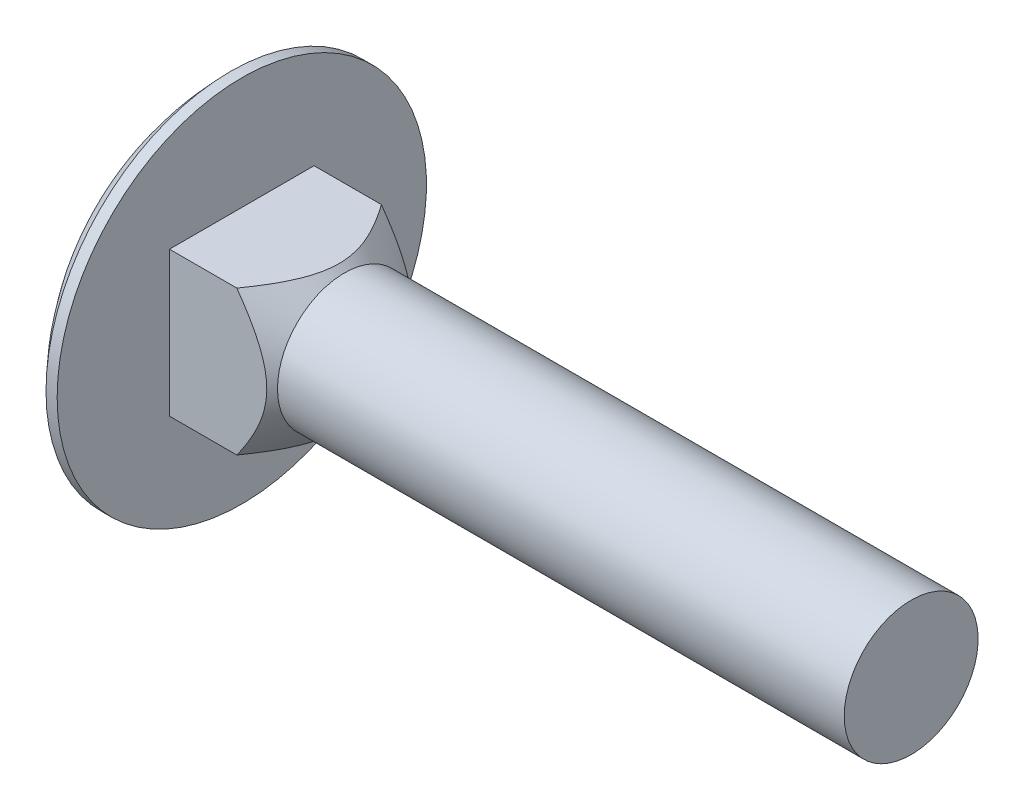
ISO-10303-21;
HEADER;
FILE_DESCRIPTION(('STEP AP214'),'2;1');
FILE_NAME('part.step','',(''),(''),'','','');
FILE_SCHEMA(('AUTOMOTIVE_DESIGN { 1 0 10303 214 1 1 1 1 }'));
ENDSEC;
DATA;
#1=APPLICATION_CONTEXT('core data for automotive mechanical design processes');
#2=APPLICATION_PROTOCOL_DEFINITION('international standard','automotive_design',2000,#1);
#3=PRODUCT_CONTEXT('',#1,'mechanical');
#4=PRODUCT('Part','Part','',(#3));
#5=PRODUCT_RELATED_PRODUCT_CATEGORY('part','',(#4));
#6=PRODUCT_DEFINITION_FORMATION('','',#4);
#7=PRODUCT_DEFINITION_CONTEXT('part definition',#1,'design');
#8=PRODUCT_DEFINITION('design','',#6,#7);
#9=PRODUCT_DEFINITION_SHAPE('','',#8);
#10=(LENGTH_UNIT() NAMED_UNIT(*) SI_UNIT(.MILLI.,.METRE.));
#11=(NAMED_UNIT(*) PLANE_ANGLE_UNIT() SI_UNIT($,.RADIAN.));
#12=(NAMED_UNIT(*) SI_UNIT($,.STERADIAN.) SOLID_ANGLE_UNIT());
#13=UNCERTAINTY_MEASURE_WITH_UNIT(LENGTH_MEASURE(1.E-05),#10,'distance_accuracy_value','');
#14=(GEOMETRIC_REPRESENTATION_CONTEXT(3) GLOBAL_UNCERTAINTY_ASSIGNED_CONTEXT((#13)) GLOBAL_UNIT_ASSIGNED_CONTEXT((#10,
#11,#12)) REPRESENTATION_CONTEXT('',''));
#15=CARTESIAN_POINT('',(0.,0.,0.));
#16=DIRECTION('',(0.,0.,1.));
#17=DIRECTION('',(1.,0.,0.));
#18=AXIS2_PLACEMENT_3D('',#15,#16,#17);
#19=CARTESIAN_POINT('',(4.6,3.24,-3.24));
#20=DIRECTION('',(0.,0.,1.));
#21=DIRECTION('',(0.,-1.,0.));
#22=AXIS2_PLACEMENT_3D('',#19,#20,#21);
#23=PLANE('',#22);
#24=CARTESIAN_POINT('',(0.120416170125069,-6.7414074397063,-3.24));
#25=CARTESIAN_POINT('',(0.25736062873696,-6.58944728740927,-3.24));
#26=CARTESIAN_POINT('',(0.393846815573473,-6.43707070925382,-3.24));
#27=CARTESIAN_POINT('',(0.665661123863793,-6.1312671177515,-3.24));
#28=CARTESIAN_POINT('',(0.800989152901168,-5.97784002230384,-3.24));
#29=CARTESIAN_POINT('',(1.07065702082592,-5.66924612356482,-3.24));
#30=CARTESIAN_POINT('',(1.20499227924482,-5.51407531108393,-3.24));
#31=CARTESIAN_POINT('',(1.47186716195841,-5.20220433515908,-3.24));
#32=CARTESIAN_POINT('',(1.60440684975769,-5.04550422614131,-3.24));
#33=CARTESIAN_POINT('',(1.87469625252643,-4.72122756794267,-3.24));
#34=CARTESIAN_POINT('',(2.0123128694796,-4.55353979098877,-3.24));
#35=CARTESIAN_POINT('',(2.28420008970127,-4.21547552728753,-3.24));
#36=CARTESIAN_POINT('',(2.41847084769173,-4.04509916546525,-3.24));
#37=CARTESIAN_POINT('',(2.68232627861573,-3.70109336187763,-3.24));
#38=CARTESIAN_POINT('',(2.8119168313737,-3.52746844969524,-3.24));
#39=CARTESIAN_POINT('',(3.06482061537789,-3.17572665708054,-3.24));
#40=CARTESIAN_POINT('',(3.1881354498348,-2.99761094144419,-3.24));
#41=CARTESIAN_POINT('',(3.39832133154884,-2.67722310032235,-3.24));
#42=CARTESIAN_POINT('',(3.48703467285581,-2.53616652454108,-3.24));
#43=CARTESIAN_POINT('',(3.65726255713617,-2.24964032099177,-3.24));
#44=CARTESIAN_POINT('',(3.73877395380492,-2.10416880139295,-3.24));
#45=CARTESIAN_POINT('',(3.89115652633997,-1.80934032100822,-3.24));
#46=CARTESIAN_POINT('',(3.9621164219209,-1.6600298009873,-3.24));
#47=CARTESIAN_POINT('',(4.09050683146268,-1.35569473684555,-3.24));
#48=CARTESIAN_POINT('',(4.14795039693274,-1.20067587347206,-3.24));
#49=CARTESIAN_POINT('',(4.22558846779131,-0.947273628729252,-3.24));
#50=CARTESIAN_POINT('',(4.25153996125965,-0.850655334613169,-3.24));
#51=CARTESIAN_POINT('',(4.29568982309763,-0.655648600709393,-3.24));
#52=CARTESIAN_POINT('',(4.31388942032129,-0.557260444064855,-3.24));
#53=CARTESIAN_POINT('',(4.34156684156055,-0.359610820542335,-3.24));
#54=CARTESIAN_POINT('',(4.35107602439263,-0.260353808887043,-3.24));
#55=CARTESIAN_POINT('',(4.36094183170725,-0.0613794653984506,-3.24));
#56=CARTESIAN_POINT('',(4.36129862388183,0.0383378579674386,-3.24));
#57=CARTESIAN_POINT('',(4.35283832123334,0.237378603091908,-3.24));
#58=CARTESIAN_POINT('',(4.34402096142676,0.336702013389639,-3.24));
#59=CARTESIAN_POINT('',(4.31771918406241,0.534183700378543,-3.24));
#60=CARTESIAN_POINT('',(4.30023406582596,0.632341882218774,-3.24));
#61=CARTESIAN_POINT('',(4.2573945237995,0.827349246915,-3.24));
#62=CARTESIAN_POINT('',(4.23200622025648,0.92419088407423,-3.24));
#63=CARTESIAN_POINT('',(4.17446445699154,1.11581908212014,-3.24));
#64=CARTESIAN_POINT('',(4.14231079903122,1.21060558269742,-3.24));
#65=CARTESIAN_POINT('',(4.06453950116689,1.41886565569307,-3.24));
#66=CARTESIAN_POINT('',(4.01751768475131,1.53181153534013,-3.24));
#67=CARTESIAN_POINT('',(3.91671541361205,1.75467118579228,-3.24));
#68=CARTESIAN_POINT('',(3.86293162642795,1.86458342875213,-3.24));
#69=CARTESIAN_POINT('',(3.74994199449218,2.08181831427032,-3.24));
#70=CARTESIAN_POINT('',(3.6907264258951,2.18913586031061,-3.24));
#71=CARTESIAN_POINT('',(3.56808414719841,2.4012987068335,-3.24));
#72=CARTESIAN_POINT('',(3.50465808606051,2.506144384944,-3.24));
#73=CARTESIAN_POINT('',(3.37351714683084,2.71519344454569,-3.24));
#74=CARTESIAN_POINT('',(3.30575408304881,2.81936645688851,-3.24));
#75=CARTESIAN_POINT('',(3.16745091463218,3.02584962244193,-3.24));
#76=CARTESIAN_POINT('',(3.09691072677368,3.12815971969076,-3.24));
#77=CARTESIAN_POINT('',(2.95366014171693,3.33107037702131,-3.24));
#78=CARTESIAN_POINT('',(2.88095230175738,3.4316727476446,-3.24));
#79=CARTESIAN_POINT('',(2.73369585527417,3.63151137580475,-3.24));
#80=CARTESIAN_POINT('',(2.65914732418408,3.73074768906542,-3.24));
#81=CARTESIAN_POINT('',(2.48904411673983,3.95356950466048,-3.24));
#82=CARTESIAN_POINT('',(2.3930434080346,4.07681415039384,-3.24));
#83=CARTESIAN_POINT('',(2.19910117753357,4.32176885465257,-3.24));
#84=CARTESIAN_POINT('',(2.10115959026957,4.44347886118535,-3.24));
#85=CARTESIAN_POINT('',(1.80496346206786,4.80672536138743,-3.24));
#86=CARTESIAN_POINT('',(1.60436164100984,5.04634718705188,-3.24));
#87=CARTESIAN_POINT('',(1.19880495079559,5.52205280844775,-3.24));
#88=CARTESIAN_POINT('',(0.99384804230474,5.75813485425661,-3.24));
#89=CARTESIAN_POINT('',(0.580866742988496,6.22760655736332,-3.24));
#90=CARTESIAN_POINT('',(0.372842273678394,6.46099614550038,-3.24));
#91=CARTESIAN_POINT('',(-0.0459273377027709,6.92624626345974,-3.24));
#92=CARTESIAN_POINT('',(-0.256677452858743,7.15810230761016,-3.24));
#93=CARTESIAN_POINT('',(-0.679912188418046,7.62023065825678,-3.24));
#94=CARTESIAN_POINT('',(-0.892396836514393,7.85050293935853,-3.24));
#95=CARTESIAN_POINT('',(-1.53171588603127,8.53932562776742,-3.24));
#96=CARTESIAN_POINT('',(-1.96054444439081,8.99602419698945,-3.24));
#97=CARTESIAN_POINT('',(-2.7673025022011,9.8488450921901,-3.24));
#98=CARTESIAN_POINT('',(-3.14483337056159,10.245345825622,-3.24));
#99=CARTESIAN_POINT('',(-3.90178375614314,11.0366083515061,-3.24));
#100=CARTESIAN_POINT('',(-4.28120344027272,11.4313699842537,-3.24));
#101=CARTESIAN_POINT('',(-5.03996312949916,12.2180953360151,-3.24));
#102=CARTESIAN_POINT('',(-5.41929802192966,12.6100639911261,-3.24));
#103=CARTESIAN_POINT('',(-6.17897101237118,13.3929516667823,-3.24));
#104=CARTESIAN_POINT('',(-6.55930900565716,13.7838707889211,-3.24));
#105=CARTESIAN_POINT('',(-6.94001542155328,14.1744293874219,-3.24));
#106=B_SPLINE_CURVE_WITH_KNOTS('',3,(#24,#25,#26,#27,#28,#29,#30,#31,#32,#33,#34,#35,#36,#37,
#38,#39,#40,#41,#42,#43,#44,#45,#46,#47,#48,#49,#50,#51,#52,#53,#54,#55,#56,#57,#58,#59,#60,#61,
#62,#63,#64,#65,#66,#67,#68,#69,#70,#71,#72,#73,#74,#75,#76,#77,#78,#79,#80,#81,#82,#83,#84,#85,
#86,#87,#88,#89,#90,#91,#92,#93,#94,#95,#96,#97,#98,#99,#100,#101,#102,#103,#104,#105),
.UNSPECIFIED.,.F.,.F.,(4,2,2,2,2,2,2,2,2,2,2,2,2,2,2,2,2,2,2,2,2,2,2,2,2,2,2,2,2,2,2,2,2,2,2,2,
2,2,2,2,4),(0.,0.613689317340484,1.22742715643208,1.84313970014903,2.45883041058956,
3.10958114212511,3.76030172505684,4.41017414568678,5.05987970622939,5.55962946354488,
6.05959647742213,6.5550877515697,7.05009859249719,7.3499622059646,7.64977826643814,
7.94850813791696,8.24723253599984,8.54596556258943,8.84472274190593,9.14477870724488,
9.44484346604788,9.81158365654415,10.1785052990716,10.5460971159382,10.9136324069677,
11.2863975997142,11.6591739718763,12.0315267342691,12.403864262477,12.872505272666,
13.3411621176853,14.2785938914772,15.2164747516066,16.1543796495519,17.0943450525182,
18.0343254921471,19.9137100660878,21.5561663210808,23.1987703864368,24.8351697964812,
26.471404639992),.UNSPECIFIED.);
#107=CARTESIAN_POINT('',(3.01794805791106,-3.24,-3.24000000000061));
#108=VERTEX_POINT('',#107);
#109=CARTESIAN_POINT('',(3.01794805791106,3.24,-3.24000000000061));
#110=VERTEX_POINT('',#109);
#111=EDGE_CURVE('E96',#108,#110,#106,.T.);
#112=ORIENTED_EDGE('',*,*,#111,.F.);
#113=DIRECTION('',(-1.,0.,0.));
#114=VECTOR('',#113,1.);
#115=CARTESIAN_POINT('',(4.6,-3.24,-3.24));
#116=LINE('',#115,#114);
#117=CARTESIAN_POINT('',(0.,-3.24,-3.24));
#118=VERTEX_POINT('',#117);
#119=EDGE_CURVE('E105',#108,#118,#116,.T.);
#120=ORIENTED_EDGE('',*,*,#119,.T.);
#121=DIRECTION('',(0.,1.,0.));
#122=VECTOR('',#121,1.);
#123=CARTESIAN_POINT('',(0.,3.24,-3.24));
#124=LINE('',#123,#122);
#125=CARTESIAN_POINT('',(0.,3.24,-3.24));
#126=VERTEX_POINT('',#125);
#127=EDGE_CURVE('E108',#118,#126,#124,.T.);
#128=ORIENTED_EDGE('',*,*,#127,.T.);
#129=DIRECTION('',(-1.,0.,0.));
#130=VECTOR('',#129,1.);
#131=CARTESIAN_POINT('',(4.6,3.24,-3.24));
#132=LINE('',#131,#130);
#133=EDGE_CURVE('E70',#110,#126,#132,.T.);
#134=ORIENTED_EDGE('',*,*,#133,.F.);
#135=EDGE_LOOP('',(#112,#120,#128,#134));
#136=FACE_BOUND('',#135,.T.);
#137=ADVANCED_FACE('F40',(#136),#23,.F.);
#138=CARTESIAN_POINT('',(4.6,3.24,3.24));
#139=DIRECTION('',(0.,-1.,0.));
#140=DIRECTION('',(0.,0.,-1.));
#141=AXIS2_PLACEMENT_3D('',#138,#139,#140);
#142=PLANE('',#141);
#143=CARTESIAN_POINT('',(0.120416397012247,3.24,-6.74140718797523));
#144=CARTESIAN_POINT('',(0.25736084617149,3.24,-6.5894470451034));
#145=CARTESIAN_POINT('',(0.393847023566096,3.24,-6.43707047638589));
#146=CARTESIAN_POINT('',(0.665661313010063,3.24,-6.13126690380304));
#147=CARTESIAN_POINT('',(0.800989332643002,3.24,-5.97783981783692));
#148=CARTESIAN_POINT('',(1.07065718176657,3.24,-5.66924593817143));
#149=CARTESIAN_POINT('',(1.20499243078909,3.24,-5.51407513528287));
#150=CARTESIAN_POINT('',(1.47186729479663,3.24,-5.2022041786282));
#151=CARTESIAN_POINT('',(1.60440697328623,3.24,-5.04550407928825));
#152=CARTESIAN_POINT('',(1.87469635953515,3.24,-4.72122743813245));
#153=CARTESIAN_POINT('',(2.01231296924024,3.24,-4.5535396685128));
#154=CARTESIAN_POINT('',(2.28420017506167,3.24,-4.21547541958202));
#155=CARTESIAN_POINT('',(2.41847092589994,3.24,-4.04509906519593));
#156=CARTESIAN_POINT('',(2.68232634270415,3.24,-3.70109327662581));
#157=CARTESIAN_POINT('',(2.81191688849407,3.24,-3.52746837202434));
#158=CARTESIAN_POINT('',(3.06482065885818,3.24,-3.17572659482914));
#159=CARTESIAN_POINT('',(3.18813548664283,3.24,-2.9976108870312));
#160=CARTESIAN_POINT('',(3.39832137140359,3.24,-2.67722303827205));
#161=CARTESIAN_POINT('',(3.48703472147538,3.24,-2.53616644637704));
#162=CARTESIAN_POINT('',(3.65726262123822,3.24,-2.24964020941729));
#163=CARTESIAN_POINT('',(3.73877402462226,3.24,-2.10416867252039));
#164=CARTESIAN_POINT('',(3.89115660683942,3.24,-1.80934015718243));
#165=CARTESIAN_POINT('',(3.96211650547658,3.24,-1.66002961955079));
#166=CARTESIAN_POINT('',(4.09050691644272,3.24,-1.35569451884629));
#167=CARTESIAN_POINT('',(4.14795048029365,3.24,-1.20067563652576));
#168=CARTESIAN_POINT('',(4.22558854094651,3.24,-0.947273368688294));
#169=CARTESIAN_POINT('',(4.25154002842363,3.24,-0.850655070821967));
#170=CARTESIAN_POINT('',(4.29568987701632,3.24,-0.655648329724568));
#171=CARTESIAN_POINT('',(4.31388946698645,3.24,-0.557260169636679));
#172=CARTESIAN_POINT('',(4.3415668726833,3.24,-0.359610539727296));
#173=CARTESIAN_POINT('',(4.35107604722261,3.24,-0.260353525125297));
#174=CARTESIAN_POINT('',(4.36094183727395,3.24,-0.0613791765202277));
#175=CARTESIAN_POINT('',(4.36129862047733,3.24,0.0383381490154808));
#176=CARTESIAN_POINT('',(4.35283829977402,3.24,0.237378896931347));
#177=CARTESIAN_POINT('',(4.34402093094838,3.24,0.336702307853424));
#178=CARTESIAN_POINT('',(4.31771913602471,3.24,0.534183995381723));
#179=CARTESIAN_POINT('',(4.30023400924767,3.24,0.632342177136899));
#180=CARTESIAN_POINT('',(4.2573944508867,3.24,0.827349541250184));
#181=CARTESIAN_POINT('',(4.23200613954735,3.24,0.924191177908111));
#182=CARTESIAN_POINT('',(4.17446436161367,3.24,1.11581937468146));
#183=CARTESIAN_POINT('',(4.14231069678194,3.24,1.21060587448777));
#184=CARTESIAN_POINT('',(4.06453937359323,3.24,1.41886597532059));
#185=CARTESIAN_POINT('',(4.01751753675131,3.24,1.53181188273558));
#186=CARTESIAN_POINT('',(3.9167152228558,3.24,1.75467158732018));
#187=CARTESIAN_POINT('',(3.86293141333946,3.24,1.86458385664321));
#188=CARTESIAN_POINT('',(3.74994173551611,3.24,2.08181879394348));
#189=CARTESIAN_POINT('',(3.69072614335789,3.24,2.18913636539877));
#190=CARTESIAN_POINT('',(3.56808381687153,3.24,2.40129926196509));
#191=CARTESIAN_POINT('',(3.50465773150558,3.24,2.50614496470436));
#192=CARTESIAN_POINT('',(3.37351674319998,3.24,2.71519407318998));
#193=CARTESIAN_POINT('',(3.30575365457046,3.24,2.81936710978396));
#194=CARTESIAN_POINT('',(3.16745043625327,3.24,3.0258503234668));
#195=CARTESIAN_POINT('',(3.09691022334166,3.24,3.12816044459382));
#196=CARTESIAN_POINT('',(2.95365958814427,3.24,3.33107114935379));
#197=CARTESIAN_POINT('',(2.88095172309835,3.24,3.43167354352932));
#198=CARTESIAN_POINT('',(2.73369522641253,3.24,3.63151221862995));
#199=CARTESIAN_POINT('',(2.65914667020615,3.24,3.73074855527884));
#200=CARTESIAN_POINT('',(2.48904343477153,3.24,3.95357038594087));
#201=CARTESIAN_POINT('',(2.39304272392734,3.24,4.0768150238814));
#202=CARTESIAN_POINT('',(2.19910049024907,3.24,4.32176971330541));
#203=CARTESIAN_POINT('',(2.1011589019469,3.24,4.44347971279636));
#204=CARTESIAN_POINT('',(1.80496277189464,3.24,4.80672619272812));
#205=CARTESIAN_POINT('',(1.6043609512619,3.24,5.04634800605598));
#206=CARTESIAN_POINT('',(1.19880426395377,3.24,5.52205360419646));
#207=CARTESIAN_POINT('',(0.993847357946783,3.24,5.75813563908907));
#208=CARTESIAN_POINT('',(0.580866064862754,3.24,6.2276073213903));
#209=CARTESIAN_POINT('',(0.372841599301107,3.24,6.46099689963823));
#210=CARTESIAN_POINT('',(-0.0459280034415185,3.24,6.92624699817664));
#211=CARTESIAN_POINT('',(-0.256678113702332,3.24,7.15810303279974));
#212=CARTESIAN_POINT('',(-0.67991283888425,3.24,7.6202313648977));
#213=CARTESIAN_POINT('',(-0.892397481498328,3.24,7.85050363697815));
#214=CARTESIAN_POINT('',(-1.53171651409696,3.24,8.53932629901567));
#215=CARTESIAN_POINT('',(-1.96054506041448,3.24,8.99602485142915));
#216=CARTESIAN_POINT('',(-2.76730311748959,3.24,9.84884573981253));
#217=CARTESIAN_POINT('',(-3.14483399741388,3.24,10.245346482994));
#218=CARTESIAN_POINT('',(-3.90178440585234,3.24,11.0366090285592));
#219=CARTESIAN_POINT('',(-4.28120410127485,3.24,11.4313706712386));
#220=CARTESIAN_POINT('',(-5.03996381385811,3.24,12.2180960439803));
#221=CARTESIAN_POINT('',(-5.41929871835656,3.24,12.6100647101359));
#222=CARTESIAN_POINT('',(-6.178971732859,3.24,13.3929524080208));
#223=CARTESIAN_POINT('',(-6.55930973813807,3.24,13.7838715413436));
#224=CARTESIAN_POINT('',(-6.9400161659924,3.24,14.1744301510615));
#225=B_SPLINE_CURVE_WITH_KNOTS('',3,(#143,#144,#145,#146,#147,#148,#149,#150,#151,#152,#153,
#154,#155,#156,#157,#158,#159,#160,#161,#162,#163,#164,#165,#166,#167,#168,#169,#170,#171,#172,
#173,#174,#175,#176,#177,#178,#179,#180,#181,#182,#183,#184,#185,#186,#187,#188,#189,#190,#191,
#192,#193,#194,#195,#196,#197,#198,#199,#200,#201,#202,#203,#204,#205,#206,#207,#208,#209,#210,
#211,#212,#213,#214,#215,#216,#217,#218,#219,#220,#221,#222,#223,#224),.UNSPECIFIED.,.F.,.F.,(4,
2,2,2,2,2,2,2,2,2,2,2,2,2,2,2,2,2,2,2,2,2,2,2,2,2,2,2,2,2,2,2,2,2,2,2,2,2,2,2,4),(0.,
0.613689277351337,1.22742707644803,1.84313957995817,2.45883025019582,3.10958095092863,
3.76030150306009,4.41017389296157,5.05987942279953,5.55962923497038,6.05959630382794,
6.55508762939305,7.05009852138514,7.34996214097857,7.6497782075645,7.94850808540368,
8.24723248986966,8.54596552074054,8.84472270435129,9.1447786742277,9.44484343752451,
9.81158372833911,10.1785054713109,10.5460973890606,10.9136327809252,11.2863980753046,
11.6591745491081,12.0315274128546,12.4038650424204,12.8725060381386,13.3411628686666,
14.2785946133404,15.2164754438787,16.1543803122098,17.0943456841551,18.0343260927446,
19.9137106052134,21.5561669053119,23.1987710156277,24.8351704746596,26.4714053673087),.UNSPECIFIED.);
#226=CARTESIAN_POINT('',(3.01794805791122,3.24,3.24));
#227=VERTEX_POINT('',#226);
#228=EDGE_CURVE('E109',#110,#227,#225,.T.);
#229=ORIENTED_EDGE('',*,*,#228,.F.);
#230=ORIENTED_EDGE('',*,*,#133,.T.);
#231=DIRECTION('',(0.,0.,1.));
#232=VECTOR('',#231,1.);
#233=CARTESIAN_POINT('',(0.,3.24,3.24));
#234=LINE('',#233,#232);
#235=CARTESIAN_POINT('',(0.,3.24,3.24));
#236=VERTEX_POINT('',#235);
#237=EDGE_CURVE('E147',#126,#236,#234,.T.);
#238=ORIENTED_EDGE('',*,*,#237,.T.);
#239=DIRECTION('',(-1.,0.,0.));
#240=VECTOR('',#239,1.);
#241=CARTESIAN_POINT('',(4.6,3.24,3.24));
#242=LINE('',#241,#240);
#243=EDGE_CURVE('E121',#227,#236,#242,.T.);
#244=ORIENTED_EDGE('',*,*,#243,.F.);
#245=EDGE_LOOP('',(#229,#230,#238,#244));
#246=FACE_BOUND('',#245,.T.);
#247=ADVANCED_FACE('F165',(#246),#142,.F.);
#248=CARTESIAN_POINT('',(4.6,3.24,3.24));
#249=DIRECTION('',(0.,0.,-1.));
#250=DIRECTION('',(0.,1.,0.));
#251=AXIS2_PLACEMENT_3D('',#248,#249,#250);
#252=PLANE('',#251);
#253=CARTESIAN_POINT('',(0.120416397012249,-6.74140718797523,3.24));
#254=CARTESIAN_POINT('',(0.257360846171492,-6.5894470451034,3.24));
#255=CARTESIAN_POINT('',(0.393847023566098,-6.43707047638589,3.24));
#256=CARTESIAN_POINT('',(0.665661313010065,-6.13126690380304,3.24));
#257=CARTESIAN_POINT('',(0.800989332643003,-5.97783981783692,3.24));
#258=CARTESIAN_POINT('',(1.07065718176657,-5.66924593817143,3.24));
#259=CARTESIAN_POINT('',(1.20499243078909,-5.51407513528287,3.24));
#260=CARTESIAN_POINT('',(1.47186729479663,-5.2022041786282,3.24));
#261=CARTESIAN_POINT('',(1.60440697328623,-5.04550407928825,3.24));
#262=CARTESIAN_POINT('',(1.87469635953515,-4.72122743813245,3.24));
#263=CARTESIAN_POINT('',(2.01231296924024,-4.5535396685128,3.24));
#264=CARTESIAN_POINT('',(2.28420017506167,-4.21547541958203,3.24));
#265=CARTESIAN_POINT('',(2.41847092589994,-4.04509906519593,3.24));
#266=CARTESIAN_POINT('',(2.68232634270415,-3.70109327662581,3.24));
#267=CARTESIAN_POINT('',(2.81191688849407,-3.52746837202434,3.24));
#268=CARTESIAN_POINT('',(3.06482065885819,-3.17572659482914,3.24));
#269=CARTESIAN_POINT('',(3.18813548664283,-2.9976108870312,3.24));
#270=CARTESIAN_POINT('',(3.39832137140359,-2.67722303827205,3.24));
#271=CARTESIAN_POINT('',(3.48703472147538,-2.53616644637704,3.24));
#272=CARTESIAN_POINT('',(3.65726262123822,-2.2496402094173,3.24));
#273=CARTESIAN_POINT('',(3.73877402462226,-2.1041686725204,3.24));
#274=CARTESIAN_POINT('',(3.89115660683942,-1.80934015718244,3.24));
#275=CARTESIAN_POINT('',(3.96211650547658,-1.66002961955079,3.24));
#276=CARTESIAN_POINT('',(4.09050691644272,-1.35569451884629,3.24));
#277=CARTESIAN_POINT('',(4.14795048029365,-1.20067563652576,3.24));
#278=CARTESIAN_POINT('',(4.22558854094651,-0.947273368688294,3.24));
#279=CARTESIAN_POINT('',(4.25154002842363,-0.850655070821967,3.24));
#280=CARTESIAN_POINT('',(4.29568987701632,-0.655648329724568,3.24));
#281=CARTESIAN_POINT('',(4.31388946698645,-0.557260169636679,3.24));
#282=CARTESIAN_POINT('',(4.3415668726833,-0.359610539727296,3.24));
#283=CARTESIAN_POINT('',(4.35107604722261,-0.260353525125296,3.24));
#284=CARTESIAN_POINT('',(4.36094183727395,-0.0613791765202274,3.24));
#285=CARTESIAN_POINT('',(4.36129862047733,0.0383381490154812,3.24));
#286=CARTESIAN_POINT('',(4.35283829977402,0.237378896931348,3.24));
#287=CARTESIAN_POINT('',(4.34402093094838,0.336702307853424,3.24));
#288=CARTESIAN_POINT('',(4.31771913602471,0.534183995381724,3.24));
#289=CARTESIAN_POINT('',(4.30023400924767,0.632342177136899,3.24));
#290=CARTESIAN_POINT('',(4.2573944508867,0.827349541250184,3.24));
#291=CARTESIAN_POINT('',(4.23200613954735,0.924191177908111,3.24));
#292=CARTESIAN_POINT('',(4.17446436161367,1.11581937468146,3.24));
#293=CARTESIAN_POINT('',(4.14231069678194,1.21060587448777,3.24));
#294=CARTESIAN_POINT('',(4.06453937359323,1.41886597532059,3.24));
#295=CARTESIAN_POINT('',(4.01751753675131,1.53181188273558,3.24));
#296=CARTESIAN_POINT('',(3.9167152228558,1.75467158732019,3.24));
#297=CARTESIAN_POINT('',(3.86293141333946,1.86458385664321,3.24));
#298=CARTESIAN_POINT('',(3.74994173551611,2.08181879394348,3.24));
#299=CARTESIAN_POINT('',(3.69072614335789,2.18913636539877,3.24));
#300=CARTESIAN_POINT('',(3.56808381687153,2.40129926196509,3.24));
#301=CARTESIAN_POINT('',(3.50465773150558,2.50614496470436,3.24));
#302=CARTESIAN_POINT('',(3.37351674319998,2.71519407318998,3.24));
#303=CARTESIAN_POINT('',(3.30575365457046,2.81936710978397,3.24));
#304=CARTESIAN_POINT('',(3.16745043625327,3.0258503234668,3.24));
#305=CARTESIAN_POINT('',(3.09691022334165,3.12816044459383,3.24));
#306=CARTESIAN_POINT('',(2.95365958814427,3.33107114935379,3.24));
#307=CARTESIAN_POINT('',(2.88095172309835,3.43167354352932,3.24));
#308=CARTESIAN_POINT('',(2.73369522641252,3.63151221862996,3.24));
#309=CARTESIAN_POINT('',(2.65914667020615,3.73074855527884,3.24));
#310=CARTESIAN_POINT('',(2.48904343477153,3.95357038594087,3.24));
#311=CARTESIAN_POINT('',(2.39304272392734,4.0768150238814,3.24));
#312=CARTESIAN_POINT('',(2.19910049024906,4.32176971330541,3.24));
#313=CARTESIAN_POINT('',(2.1011589019469,4.44347971279636,3.24));
#314=CARTESIAN_POINT('',(1.80496277189464,4.80672619272812,3.24));
#315=CARTESIAN_POINT('',(1.6043609512619,5.04634800605598,3.24));
#316=CARTESIAN_POINT('',(1.19880426395377,5.52205360419646,3.24));
#317=CARTESIAN_POINT('',(0.993847357946783,5.75813563908907,3.24));
#318=CARTESIAN_POINT('',(0.580866064862754,6.2276073213903,3.24));
#319=CARTESIAN_POINT('',(0.372841599301108,6.46099689963823,3.24));
#320=CARTESIAN_POINT('',(-0.0459280034415153,6.92624699817664,3.24));
#321=CARTESIAN_POINT('',(-0.256678113702327,7.15810303279974,3.24));
#322=CARTESIAN_POINT('',(-0.679912838884245,7.62023136489769,3.24));
#323=CARTESIAN_POINT('',(-0.892397481498324,7.85050363697815,3.24));
#324=CARTESIAN_POINT('',(-1.53171651409696,8.53932629901566,3.24));
#325=CARTESIAN_POINT('',(-1.96054506041447,8.99602485142915,3.24));
#326=CARTESIAN_POINT('',(-2.76730311748958,9.84884573981252,3.24));
#327=CARTESIAN_POINT('',(-3.14483399741388,10.245346482994,3.24));
#328=CARTESIAN_POINT('',(-3.90178440585233,11.0366090285592,3.24));
#329=CARTESIAN_POINT('',(-4.28120410127485,11.4313706712386,3.24));
#330=CARTESIAN_POINT('',(-5.03996381385811,12.2180960439803,3.24));
#331=CARTESIAN_POINT('',(-5.41929871835656,12.6100647101359,3.24));
#332=CARTESIAN_POINT('',(-6.178971732859,13.3929524080208,3.24));
#333=CARTESIAN_POINT('',(-6.55930973813807,13.7838715413436,3.24));
#334=CARTESIAN_POINT('',(-6.9400161659924,14.1744301510615,3.24));
#335=B_SPLINE_CURVE_WITH_KNOTS('',3,(#253,#254,#255,#256,#257,#258,#259,#260,#261,#262,#263,
#264,#265,#266,#267,#268,#269,#270,#271,#272,#273,#274,#275,#276,#277,#278,#279,#280,#281,#282,
#283,#284,#285,#286,#287,#288,#289,#290,#291,#292,#293,#294,#295,#296,#297,#298,#299,#300,#301,
#302,#303,#304,#305,#306,#307,#308,#309,#310,#311,#312,#313,#314,#315,#316,#317,#318,#319,#320,
#321,#322,#323,#324,#325,#326,#327,#328,#329,#330,#331,#332,#333,#334),.UNSPECIFIED.,.F.,.F.,(4,
2,2,2,2,2,2,2,2,2,2,2,2,2,2,2,2,2,2,2,2,2,2,2,2,2,2,2,2,2,2,2,2,2,2,2,2,2,2,2,4),(0.,
0.613689277351336,1.22742707644803,1.84313957995817,2.45883025019581,3.10958095092863,
3.76030150306009,4.41017389296157,5.05987942279953,5.55962923497037,6.05959630382794,
6.55508762939304,7.05009852138514,7.34996214097857,7.64977820756449,7.94850808540367,
8.24723248986966,8.54596552074054,8.84472270435129,9.14477867422769,9.4448434375245,
9.81158372833911,10.1785054713109,10.5460973890606,10.9136327809252,11.2863980753046,
11.6591745491081,12.0315274128546,12.4038650424204,12.8725060381386,13.3411628686666,
14.2785946133404,15.2164754438787,16.1543803122098,17.094345684155,18.0343260927446,
19.9137106052134,21.5561669053119,23.1987710156277,24.8351704746596,26.4714053673087),.UNSPECIFIED.);
#336=CARTESIAN_POINT('',(3.01794805791122,-3.24,3.24));
#337=VERTEX_POINT('',#336);
#338=EDGE_CURVE('E60',#227,#337,#335,.F.);
#339=ORIENTED_EDGE('',*,*,#338,.F.);
#340=ORIENTED_EDGE('',*,*,#243,.T.);
#341=DIRECTION('',(0.,-1.,0.));
#342=VECTOR('',#341,1.);
#343=CARTESIAN_POINT('',(0.,3.24,3.24));
#344=LINE('',#343,#342);
#345=CARTESIAN_POINT('',(0.,-3.24,3.24));
#346=VERTEX_POINT('',#345);
#347=EDGE_CURVE('E123',#236,#346,#344,.T.);
#348=ORIENTED_EDGE('',*,*,#347,.T.);
#349=DIRECTION('',(-1.,0.,0.));
#350=VECTOR('',#349,1.);
#351=CARTESIAN_POINT('',(4.6,-3.24,3.24));
#352=LINE('',#351,#350);
#353=EDGE_CURVE('E116',#337,#346,#352,.T.);
#354=ORIENTED_EDGE('',*,*,#353,.F.);
#355=EDGE_LOOP('',(#339,#340,#348,#354));
#356=FACE_BOUND('',#355,.T.);
#357=ADVANCED_FACE('F163',(#356),#252,.F.);
#358=CARTESIAN_POINT('',(4.6,-3.24,3.24));
#359=DIRECTION('',(0.,1.,0.));
#360=DIRECTION('',(0.,0.,1.));
#361=AXIS2_PLACEMENT_3D('',#358,#359,#360);
#362=PLANE('',#361);
#363=CARTESIAN_POINT('',(0.120416397012247,-3.24,-6.74140718797523));
#364=CARTESIAN_POINT('',(0.257360846171489,-3.24,-6.5894470451034));
#365=CARTESIAN_POINT('',(0.393847023566095,-3.24,-6.43707047638589));
#366=CARTESIAN_POINT('',(0.665661313010063,-3.24,-6.13126690380304));
#367=CARTESIAN_POINT('',(0.800989332643001,-3.24,-5.97783981783692));
#368=CARTESIAN_POINT('',(1.07065718176657,-3.24,-5.66924593817143));
#369=CARTESIAN_POINT('',(1.20499243078909,-3.24,-5.51407513528287));
#370=CARTESIAN_POINT('',(1.47186729479663,-3.24,-5.2022041786282));
#371=CARTESIAN_POINT('',(1.60440697328623,-3.24,-5.04550407928826));
#372=CARTESIAN_POINT('',(1.87469635953514,-3.24,-4.72122743813245));
#373=CARTESIAN_POINT('',(2.01231296924024,-3.24,-4.55353966851281));
#374=CARTESIAN_POINT('',(2.28420017506166,-3.24,-4.21547541958203));
#375=CARTESIAN_POINT('',(2.41847092589994,-3.24,-4.04509906519593));
#376=CARTESIAN_POINT('',(2.68232634270414,-3.24,-3.70109327662581));
#377=CARTESIAN_POINT('',(2.81191688849407,-3.24,-3.52746837202434));
#378=CARTESIAN_POINT('',(3.06482065885818,-3.24,-3.17572659482914));
#379=CARTESIAN_POINT('',(3.18813548664283,-3.24,-2.9976108870312));
#380=CARTESIAN_POINT('',(3.39832137140359,-3.24,-2.67722303827205));
#381=CARTESIAN_POINT('',(3.48703472147538,-3.24,-2.53616644637704));
#382=CARTESIAN_POINT('',(3.65726262123822,-3.24,-2.24964020941729));
#383=CARTESIAN_POINT('',(3.73877402462226,-3.24,-2.1041686725204));
#384=CARTESIAN_POINT('',(3.89115660683942,-3.24,-1.80934015718243));
#385=CARTESIAN_POINT('',(3.96211650547658,-3.24,-1.66002961955079));
#386=CARTESIAN_POINT('',(4.09050691644272,-3.24,-1.35569451884629));
#387=CARTESIAN_POINT('',(4.14795048029365,-3.24,-1.20067563652575));
#388=CARTESIAN_POINT('',(4.22558854094651,-3.24,-0.947273368688292));
#389=CARTESIAN_POINT('',(4.25154002842363,-3.24,-0.850655070821965));
#390=CARTESIAN_POINT('',(4.29568987701632,-3.24,-0.655648329724566));
#391=CARTESIAN_POINT('',(4.31388946698645,-3.24,-0.557260169636678));
#392=CARTESIAN_POINT('',(4.3415668726833,-3.24,-0.359610539727294));
#393=CARTESIAN_POINT('',(4.35107604722261,-3.24,-0.260353525125294));
#394=CARTESIAN_POINT('',(4.36094183727395,-3.24,-0.0613791765202251));
#395=CARTESIAN_POINT('',(4.36129862047733,-3.24,0.0383381490154832));
#396=CARTESIAN_POINT('',(4.35283829977402,-3.24,0.23737889693135));
#397=CARTESIAN_POINT('',(4.34402093094838,-3.24,0.336702307853426));
#398=CARTESIAN_POINT('',(4.3177191360247,-3.24,0.534183995381726));
#399=CARTESIAN_POINT('',(4.30023400924767,-3.24,0.632342177136901));
#400=CARTESIAN_POINT('',(4.2573944508867,-3.24,0.827349541250186));
#401=CARTESIAN_POINT('',(4.23200613954735,-3.24,0.924191177908113));
#402=CARTESIAN_POINT('',(4.17446436161367,-3.24,1.11581937468146));
#403=CARTESIAN_POINT('',(4.14231069678194,-3.24,1.21060587448777));
#404=CARTESIAN_POINT('',(4.06453937359323,-3.24,1.41886597532059));
#405=CARTESIAN_POINT('',(4.01751753675131,-3.24,1.53181188273558));
#406=CARTESIAN_POINT('',(3.9167152228558,-3.24,1.75467158732019));
#407=CARTESIAN_POINT('',(3.86293141333946,-3.24,1.86458385664321));
#408=CARTESIAN_POINT('',(3.74994173551611,-3.24,2.08181879394348));
#409=CARTESIAN_POINT('',(3.69072614335788,-3.24,2.18913636539878));
#410=CARTESIAN_POINT('',(3.56808381687153,-3.24,2.4012992619651));
#411=CARTESIAN_POINT('',(3.50465773150557,-3.24,2.50614496470436));
#412=CARTESIAN_POINT('',(3.37351674319998,-3.24,2.71519407318998));
#413=CARTESIAN_POINT('',(3.30575365457046,-3.24,2.81936710978397));
#414=CARTESIAN_POINT('',(3.16745043625327,-3.24,3.0258503234668));
#415=CARTESIAN_POINT('',(3.09691022334165,-3.24,3.12816044459383));
#416=CARTESIAN_POINT('',(2.95365958814427,-3.24,3.3310711493538));
#417=CARTESIAN_POINT('',(2.88095172309834,-3.24,3.43167354352933));
#418=CARTESIAN_POINT('',(2.73369522641252,-3.24,3.63151221862996));
#419=CARTESIAN_POINT('',(2.65914667020614,-3.24,3.73074855527885));
#420=CARTESIAN_POINT('',(2.48904343477153,-3.24,3.95357038594088));
#421=CARTESIAN_POINT('',(2.39304272392734,-3.24,4.07681502388141));
#422=CARTESIAN_POINT('',(2.19910049024906,-3.24,4.32176971330541));
#423=CARTESIAN_POINT('',(2.10115890194689,-3.24,4.44347971279637));
#424=CARTESIAN_POINT('',(1.80496277189464,-3.24,4.80672619272813));
#425=CARTESIAN_POINT('',(1.60436095126189,-3.24,5.04634800605599));
#426=CARTESIAN_POINT('',(1.19880426395376,-3.24,5.52205360419647));
#427=CARTESIAN_POINT('',(0.993847357946778,-3.24,5.75813563908907));
#428=CARTESIAN_POINT('',(0.580866064862749,-3.24,6.22760732139031));
#429=CARTESIAN_POINT('',(0.372841599301102,-3.24,6.46099689963824));
#430=CARTESIAN_POINT('',(-0.0459280034415223,-3.24,6.92624699817665));
#431=CARTESIAN_POINT('',(-0.256678113702335,-3.24,7.15810303279975));
#432=CARTESIAN_POINT('',(-0.679912838884253,-3.24,7.6202313648977));
#433=CARTESIAN_POINT('',(-0.892397481498333,-3.24,7.85050363697815));
#434=CARTESIAN_POINT('',(-1.53171651409697,-3.24,8.53932629901567));
#435=CARTESIAN_POINT('',(-1.96054506041448,-3.24,8.99602485142916));
#436=CARTESIAN_POINT('',(-2.76730311748959,-3.24,9.84884573981254));
#437=CARTESIAN_POINT('',(-3.14483399741389,-3.24,10.245346482994));
#438=CARTESIAN_POINT('',(-3.90178440585234,-3.24,11.0366090285592));
#439=CARTESIAN_POINT('',(-4.28120410127486,-3.24,11.4313706712386));
#440=CARTESIAN_POINT('',(-5.03996381385812,-3.24,12.2180960439803));
#441=CARTESIAN_POINT('',(-5.41929871835657,-3.24,12.6100647101359));
#442=CARTESIAN_POINT('',(-6.17897173285901,-3.24,13.3929524080208));
#443=CARTESIAN_POINT('',(-6.55930973813808,-3.24,13.7838715413436));
#444=CARTESIAN_POINT('',(-6.94001616599241,-3.24,14.1744301510616));
#445=B_SPLINE_CURVE_WITH_KNOTS('',3,(#363,#364,#365,#366,#367,#368,#369,#370,#371,#372,#373,
#374,#375,#376,#377,#378,#379,#380,#381,#382,#383,#384,#385,#386,#387,#388,#389,#390,#391,#392,
#393,#394,#395,#396,#397,#398,#399,#400,#401,#402,#403,#404,#405,#406,#407,#408,#409,#410,#411,
#412,#413,#414,#415,#416,#417,#418,#419,#420,#421,#422,#423,#424,#425,#426,#427,#428,#429,#430,
#431,#432,#433,#434,#435,#436,#437,#438,#439,#440,#441,#442,#443,#444),.UNSPECIFIED.,.F.,.F.,(4,
2,2,2,2,2,2,2,2,2,2,2,2,2,2,2,2,2,2,2,2,2,2,2,2,2,2,2,2,2,2,2,2,2,2,2,2,2,2,2,4),(0.,
0.613689277351337,1.22742707644803,1.84313957995817,2.45883025019582,3.10958095092863,
3.76030150306009,4.41017389296157,5.05987942279953,5.55962923497038,6.05959630382794,
6.55508762939305,7.05009852138514,7.34996214097858,7.6497782075645,7.94850808540368,
8.24723248986967,8.54596552074054,8.84472270435129,9.1447786742277,9.44484343752451,
9.81158372833912,10.1785054713109,10.5460973890606,10.9136327809252,11.2863980753046,
11.6591745491081,12.0315274128546,12.4038650424204,12.8725060381386,13.3411628686666,
14.2785946133404,15.2164754438788,16.1543803122098,17.0943456841551,18.0343260927446,
19.9137106052134,21.5561669053119,23.1987710156277,24.8351704746596,26.4714053673087),.UNSPECIFIED.);
#446=EDGE_CURVE('E93',#337,#108,#445,.F.);
#447=ORIENTED_EDGE('',*,*,#446,.F.);
#448=ORIENTED_EDGE('',*,*,#353,.T.);
#449=DIRECTION('',(0.,0.,-1.));
#450=VECTOR('',#449,1.);
#451=CARTESIAN_POINT('',(0.,-3.24,3.24));
#452=LINE('',#451,#450);
#453=EDGE_CURVE('E114',#346,#118,#452,.T.);
#454=ORIENTED_EDGE('',*,*,#453,.T.);
#455=ORIENTED_EDGE('',*,*,#119,.F.);
#456=EDGE_LOOP('',(#447,#448,#454,#455));
#457=FACE_BOUND('',#456,.T.);
#458=ADVANCED_FACE('F112',(#457),#362,.F.);
#459=CARTESIAN_POINT('',(0.,3.,0.));
#460=DIRECTION('',(-1.,0.,0.));
#461=DIRECTION('',(0.,0.,1.));
#462=AXIS2_PLACEMENT_3D('',#459,#460,#461);
#463=PLANE('',#462);
#464=CARTESIAN_POINT('',(0.,0.,0.));
#465=DIRECTION('',(-1.,0.,0.));
#466=DIRECTION('',(0.,0.,1.));
#467=AXIS2_PLACEMENT_3D('',#464,#465,#466);
#468=CIRCLE('',#467,8.275);
#469=CARTESIAN_POINT('',(0.,0.,8.275));
#470=VERTEX_POINT('',#469);
#471=EDGE_CURVE('E49',#470,#470,#468,.T.);
#472=ORIENTED_EDGE('',*,*,#471,.F.);
#473=EDGE_LOOP('',(#472));
#474=FACE_BOUND('',#473,.T.);
#475=ORIENTED_EDGE('',*,*,#127,.F.);
#476=ORIENTED_EDGE('',*,*,#453,.F.);
#477=ORIENTED_EDGE('',*,*,#347,.F.);
#478=ORIENTED_EDGE('',*,*,#237,.F.);
#479=EDGE_LOOP('',(#475,#476,#477,#478));
#480=FACE_BOUND('',#479,.T.);
#481=ADVANCED_FACE('F141',(#474,#480),#463,.F.);
#482=CARTESIAN_POINT('',(-946.390579576086,0.,0.));
#483=DIRECTION('',(-1.,0.,0.));
#484=DIRECTION('',(0.,0.,1.));
#485=AXIS2_PLACEMENT_3D('',#482,#483,#484);
#486=CYLINDRICAL_SURFACE('',#485,8.27499999994819);
#487=CARTESIAN_POINT('',(-0.499999999894363,0.,0.));
#488=DIRECTION('',(-1.,0.,0.));
#489=DIRECTION('',(0.,0.,1.));
#490=AXIS2_PLACEMENT_3D('',#487,#488,#489);
#491=CIRCLE('',#490,8.27499999989639);
#492=CARTESIAN_POINT('',(-0.499999999894363,0.,8.27499999989639));
#493=VERTEX_POINT('',#492);
#494=EDGE_CURVE('E131',#493,#493,#491,.T.);
#495=ORIENTED_EDGE('',*,*,#494,.F.);
#496=EDGE_LOOP('',(#495));
#497=FACE_BOUND('',#496,.T.);
#498=ORIENTED_EDGE('',*,*,#471,.T.);
#499=EDGE_LOOP('',(#498));
#500=FACE_BOUND('',#499,.T.);
#501=ADVANCED_FACE('F139',(#497,#500),#486,.T.);
#502=CARTESIAN_POINT('',(7.93953032440874,0.,0.));
#503=DIRECTION('',(-1.,0.,0.));
#504=DIRECTION('',(0.,1.,0.));
#505=AXIS2_PLACEMENT_3D('',#502,#503,#504);
#506=SPHERICAL_SURFACE('',#505,11.8195303245567);
#507=ORIENTED_EDGE('',*,*,#494,.T.);
#508=EDGE_LOOP('',(#507));
#509=FACE_BOUND('',#508,.T.);
#510=ADVANCED_FACE('F184',(#509),#506,.T.);
#511=CARTESIAN_POINT('',(4.60000000000005,0.,0.));
#512=DIRECTION('',(-1.,0.,0.));
#513=DIRECTION('',(0.,0.,1.));
#514=AXIS2_PLACEMENT_3D('',#511,#512,#513);
#515=CONICAL_SURFACE('',#514,3.,0.78539816339745);
#516=CARTESIAN_POINT('',(4.60000000000005,0.,0.));
#517=DIRECTION('',(1.,0.,0.));
#518=DIRECTION('',(0.,0.,-1.));
#519=AXIS2_PLACEMENT_3D('',#516,#517,#518);
#520=CIRCLE('',#519,3.);
#521=CARTESIAN_POINT('',(4.60000000000005,0.,-3.));
#522=VERTEX_POINT('',#521);
#523=EDGE_CURVE('E101',#522,#522,#520,.T.);
#524=ORIENTED_EDGE('',*,*,#523,.F.);
#525=EDGE_LOOP('',(#524));
#526=FACE_BOUND('',#525,.T.);
#527=ORIENTED_EDGE('',*,*,#111,.T.);
#528=ORIENTED_EDGE('',*,*,#228,.T.);
#529=ORIENTED_EDGE('',*,*,#338,.T.);
#530=ORIENTED_EDGE('',*,*,#446,.T.);
#531=EDGE_LOOP('',(#527,#528,#529,#530));
#532=FACE_BOUND('',#531,.T.);
#533=ADVANCED_FACE('F95',(#526,#532),#515,.T.);
#534=CARTESIAN_POINT('',(30.,0.,0.));
#535=DIRECTION('',(-1.,0.,0.));
#536=DIRECTION('',(0.,0.,1.));
#537=AXIS2_PLACEMENT_3D('',#534,#535,#536);
#538=PLANE('',#537);
#539=CARTESIAN_POINT('',(30.,0.,0.));
#540=DIRECTION('',(-1.,0.,0.));
#541=DIRECTION('',(0.,0.,1.));
#542=AXIS2_PLACEMENT_3D('',#539,#540,#541);
#543=CIRCLE('',#542,3.);
#544=CARTESIAN_POINT('',(30.,0.,3.));
#545=VERTEX_POINT('',#544);
#546=EDGE_CURVE('E11',#545,#545,#543,.T.);
#547=ORIENTED_EDGE('',*,*,#546,.F.);
#548=EDGE_LOOP('',(#547));
#549=FACE_BOUND('',#548,.T.);
#550=ADVANCED_FACE('F42',(#549),#538,.F.);
#551=CARTESIAN_POINT('',(-946.390579576086,0.,0.));
#552=DIRECTION('',(-1.,0.,0.));
#553=DIRECTION('',(0.,0.,1.));
#554=AXIS2_PLACEMENT_3D('',#551,#552,#553);
#555=CYLINDRICAL_SURFACE('',#554,3.);
#556=ORIENTED_EDGE('',*,*,#523,.T.);
#557=EDGE_LOOP('',(#556));
#558=FACE_BOUND('',#557,.T.);
#559=ORIENTED_EDGE('',*,*,#546,.T.);
#560=EDGE_LOOP('',(#559));
#561=FACE_BOUND('',#560,.T.);
#562=ADVANCED_FACE('F199',(#558,#561),#555,.T.);
#563=CLOSED_SHELL('',(#137,#247,#357,#458,#481,#501,#510,#533,#550,#562));
#564=MANIFOLD_SOLID_BREP('B2',#563);
#565=ADVANCED_BREP_SHAPE_REPRESENTATION('',(#18,#564),#14);
#566=SHAPE_DEFINITION_REPRESENTATION(#9,#565);
ENDSEC;
END-ISO-10303-21;
